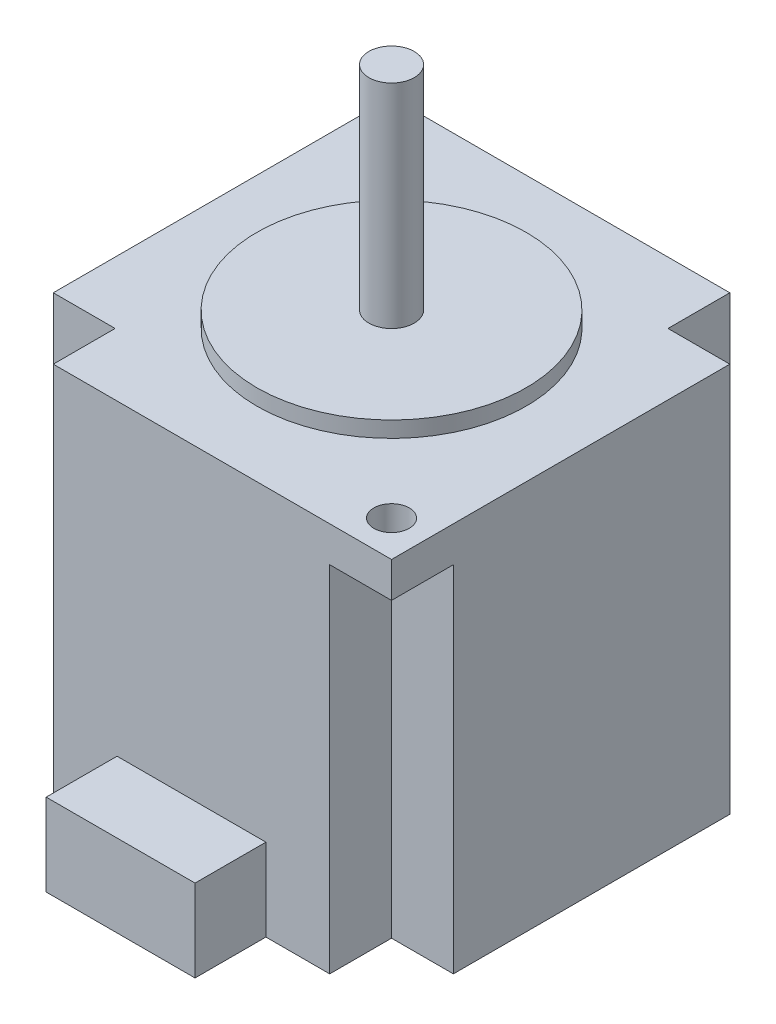
ISO-10303-21;
HEADER;
FILE_DESCRIPTION(('STEP AP214'),'2;1');
FILE_NAME('part.step','',(''),(''),'','','');
FILE_SCHEMA(('AUTOMOTIVE_DESIGN { 1 0 10303 214 1 1 1 1 }'));
ENDSEC;
DATA;
#1=APPLICATION_CONTEXT('core data for automotive mechanical design processes');
#2=APPLICATION_PROTOCOL_DEFINITION('international standard','automotive_design',2000,#1);
#3=PRODUCT_CONTEXT('',#1,'mechanical');
#4=PRODUCT('Part','Part','',(#3));
#5=PRODUCT_RELATED_PRODUCT_CATEGORY('part','',(#4));
#6=PRODUCT_DEFINITION_FORMATION('','',#4);
#7=PRODUCT_DEFINITION_CONTEXT('part definition',#1,'design');
#8=PRODUCT_DEFINITION('design','',#6,#7);
#9=PRODUCT_DEFINITION_SHAPE('','',#8);
#10=(LENGTH_UNIT() NAMED_UNIT(*) SI_UNIT(.MILLI.,.METRE.));
#11=(NAMED_UNIT(*) PLANE_ANGLE_UNIT() SI_UNIT($,.RADIAN.));
#12=(NAMED_UNIT(*) SI_UNIT($,.STERADIAN.) SOLID_ANGLE_UNIT());
#13=UNCERTAINTY_MEASURE_WITH_UNIT(LENGTH_MEASURE(1.E-05),#10,'distance_accuracy_value','');
#14=(GEOMETRIC_REPRESENTATION_CONTEXT(3) GLOBAL_UNCERTAINTY_ASSIGNED_CONTEXT((#13)) GLOBAL_UNIT_ASSIGNED_CONTEXT((#10,
#11,#12)) REPRESENTATION_CONTEXT('',''));
#15=CARTESIAN_POINT('',(0.,0.,0.));
#16=DIRECTION('',(0.,0.,1.));
#17=DIRECTION('',(1.,0.,0.));
#18=AXIS2_PLACEMENT_3D('',#15,#16,#17);
#19=CARTESIAN_POINT('',(-28.225,55.,28.225));
#20=DIRECTION('',(0.,0.,-1.));
#21=DIRECTION('',(-1.,0.,0.));
#22=AXIS2_PLACEMENT_3D('',#19,#20,#21);
#23=PLANE('',#22);
#24=DIRECTION('',(0.,-1.,0.));
#25=VECTOR('',#24,1.);
#26=CARTESIAN_POINT('',(-10.5,11.6,28.225));
#27=LINE('',#26,#25);
#28=CARTESIAN_POINT('',(-10.5,11.6,28.225));
#29=VERTEX_POINT('',#28);
#30=CARTESIAN_POINT('',(-10.5,0.,28.225));
#31=VERTEX_POINT('',#30);
#32=EDGE_CURVE('E187',#29,#31,#27,.T.);
#33=ORIENTED_EDGE('',*,*,#32,.F.);
#34=DIRECTION('',(1.,0.,0.));
#35=VECTOR('',#34,1.);
#36=CARTESIAN_POINT('',(0.,11.6,28.225));
#37=LINE('',#36,#35);
#38=CARTESIAN_POINT('',(10.5,11.6,28.225));
#39=VERTEX_POINT('',#38);
#40=EDGE_CURVE('E180',#29,#39,#37,.T.);
#41=ORIENTED_EDGE('',*,*,#40,.T.);
#42=DIRECTION('',(0.,-1.,0.));
#43=VECTOR('',#42,1.);
#44=CARTESIAN_POINT('',(10.5,11.6,28.225));
#45=LINE('',#44,#43);
#46=CARTESIAN_POINT('',(10.5,0.,28.225));
#47=VERTEX_POINT('',#46);
#48=EDGE_CURVE('E166',#39,#47,#45,.T.);
#49=ORIENTED_EDGE('',*,*,#48,.T.);
#50=DIRECTION('',(1.,0.,0.));
#51=VECTOR('',#50,1.);
#52=CARTESIAN_POINT('',(-28.225,0.,28.225));
#53=LINE('',#52,#51);
#54=CARTESIAN_POINT('',(19.5,0.,28.225));
#55=VERTEX_POINT('',#54);
#56=EDGE_CURVE('E316',#47,#55,#53,.T.);
#57=ORIENTED_EDGE('',*,*,#56,.T.);
#58=DIRECTION('',(0.,-1.,0.));
#59=VECTOR('',#58,1.);
#60=CARTESIAN_POINT('',(19.5,50.,28.225));
#61=LINE('',#60,#59);
#62=CARTESIAN_POINT('',(19.5,50.,28.225));
#63=VERTEX_POINT('',#62);
#64=EDGE_CURVE('E219',#63,#55,#61,.T.);
#65=ORIENTED_EDGE('',*,*,#64,.F.);
#66=DIRECTION('',(1.,0.,0.));
#67=VECTOR('',#66,1.);
#68=CARTESIAN_POINT('',(19.5,50.,28.225));
#69=LINE('',#68,#67);
#70=CARTESIAN_POINT('',(28.225,50.,28.225));
#71=VERTEX_POINT('',#70);
#72=EDGE_CURVE('E216',#63,#71,#69,.T.);
#73=ORIENTED_EDGE('',*,*,#72,.T.);
#74=DIRECTION('',(0.,-1.,0.));
#75=VECTOR('',#74,1.);
#76=CARTESIAN_POINT('',(28.225,55.,28.225));
#77=LINE('',#76,#75);
#78=CARTESIAN_POINT('',(28.225,55.,28.225));
#79=VERTEX_POINT('',#78);
#80=EDGE_CURVE('E309',#79,#71,#77,.T.);
#81=ORIENTED_EDGE('',*,*,#80,.F.);
#82=DIRECTION('',(1.,0.,0.));
#83=VECTOR('',#82,1.);
#84=CARTESIAN_POINT('',(-28.225,55.,28.225));
#85=LINE('',#84,#83);
#86=CARTESIAN_POINT('',(-19.5,55.,28.225));
#87=VERTEX_POINT('',#86);
#88=EDGE_CURVE('E307',#87,#79,#85,.T.);
#89=ORIENTED_EDGE('',*,*,#88,.F.);
#90=DIRECTION('',(0.,-1.,0.));
#91=VECTOR('',#90,1.);
#92=CARTESIAN_POINT('',(-19.5,67.3390133317052,28.225));
#93=LINE('',#92,#91);
#94=CARTESIAN_POINT('',(-19.5,0.,28.225));
#95=VERTEX_POINT('',#94);
#96=EDGE_CURVE('E266',#87,#95,#93,.T.);
#97=ORIENTED_EDGE('',*,*,#96,.T.);
#98=EDGE_CURVE('E302',#95,#31,#53,.T.);
#99=ORIENTED_EDGE('',*,*,#98,.T.);
#100=EDGE_LOOP('',(#33,#41,#49,#57,#65,#73,#81,#89,#97,#99));
#101=FACE_BOUND('',#100,.T.);
#102=ADVANCED_FACE('F40',(#101),#23,.F.);
#103=CARTESIAN_POINT('',(28.225,55.,-28.225));
#104=DIRECTION('',(-1.,0.,0.));
#105=DIRECTION('',(0.,0.,1.));
#106=AXIS2_PLACEMENT_3D('',#103,#104,#105);
#107=PLANE('',#106);
#108=DIRECTION('',(0.,-1.,0.));
#109=VECTOR('',#108,1.);
#110=CARTESIAN_POINT('',(28.225,50.,19.5));
#111=LINE('',#110,#109);
#112=CARTESIAN_POINT('',(28.225,50.,19.5));
#113=VERTEX_POINT('',#112);
#114=CARTESIAN_POINT('',(28.225,0.,19.5));
#115=VERTEX_POINT('',#114);
#116=EDGE_CURVE('E230',#113,#115,#111,.T.);
#117=ORIENTED_EDGE('',*,*,#116,.T.);
#118=DIRECTION('',(0.,0.,-1.));
#119=VECTOR('',#118,1.);
#120=CARTESIAN_POINT('',(28.225,0.,-28.225));
#121=LINE('',#120,#119);
#122=CARTESIAN_POINT('',(28.225,0.,-19.5));
#123=VERTEX_POINT('',#122);
#124=EDGE_CURVE('E295',#115,#123,#121,.T.);
#125=ORIENTED_EDGE('',*,*,#124,.T.);
#126=DIRECTION('',(0.,-1.,0.));
#127=VECTOR('',#126,1.);
#128=CARTESIAN_POINT('',(28.225,67.3390133317052,-19.5));
#129=LINE('',#128,#127);
#130=CARTESIAN_POINT('',(28.225,55.,-19.5));
#131=VERTEX_POINT('',#130);
#132=EDGE_CURVE('E273',#131,#123,#129,.T.);
#133=ORIENTED_EDGE('',*,*,#132,.F.);
#134=DIRECTION('',(0.,0.,-1.));
#135=VECTOR('',#134,1.);
#136=CARTESIAN_POINT('',(28.225,55.,-28.225));
#137=LINE('',#136,#135);
#138=EDGE_CURVE('E298',#79,#131,#137,.T.);
#139=ORIENTED_EDGE('',*,*,#138,.F.);
#140=ORIENTED_EDGE('',*,*,#80,.T.);
#141=DIRECTION('',(0.,0.,-1.));
#142=VECTOR('',#141,1.);
#143=CARTESIAN_POINT('',(28.225,50.,28.225));
#144=LINE('',#143,#142);
#145=EDGE_CURVE('E208',#71,#113,#144,.T.);
#146=ORIENTED_EDGE('',*,*,#145,.T.);
#147=EDGE_LOOP('',(#117,#125,#133,#139,#140,#146));
#148=FACE_BOUND('',#147,.T.);
#149=ADVANCED_FACE('F42',(#148),#107,.F.);
#150=CARTESIAN_POINT('',(-28.225,55.,-28.225));
#151=DIRECTION('',(0.,0.,1.));
#152=DIRECTION('',(1.,0.,0.));
#153=AXIS2_PLACEMENT_3D('',#150,#151,#152);
#154=PLANE('',#153);
#155=DIRECTION('',(0.,-1.,0.));
#156=VECTOR('',#155,1.);
#157=CARTESIAN_POINT('',(-19.5,50.,-28.225));
#158=LINE('',#157,#156);
#159=CARTESIAN_POINT('',(-19.5,50.,-28.225));
#160=VERTEX_POINT('',#159);
#161=CARTESIAN_POINT('',(-19.5,0.,-28.225));
#162=VERTEX_POINT('',#161);
#163=EDGE_CURVE('E65',#160,#162,#158,.T.);
#164=ORIENTED_EDGE('',*,*,#163,.F.);
#165=DIRECTION('',(-1.,0.,0.));
#166=VECTOR('',#165,1.);
#167=CARTESIAN_POINT('',(-19.5,50.,-28.225));
#168=LINE('',#167,#166);
#169=CARTESIAN_POINT('',(-28.225,50.,-28.225));
#170=VERTEX_POINT('',#169);
#171=EDGE_CURVE('E242',#160,#170,#168,.T.);
#172=ORIENTED_EDGE('',*,*,#171,.T.);
#173=DIRECTION('',(0.,-1.,0.));
#174=VECTOR('',#173,1.);
#175=CARTESIAN_POINT('',(-28.225,55.,-28.225));
#176=LINE('',#175,#174);
#177=CARTESIAN_POINT('',(-28.225,55.,-28.225));
#178=VERTEX_POINT('',#177);
#179=EDGE_CURVE('E44',#178,#170,#176,.T.);
#180=ORIENTED_EDGE('',*,*,#179,.F.);
#181=DIRECTION('',(-1.,0.,0.));
#182=VECTOR('',#181,1.);
#183=CARTESIAN_POINT('',(-28.225,55.,-28.225));
#184=LINE('',#183,#182);
#185=CARTESIAN_POINT('',(19.5,55.,-28.225));
#186=VERTEX_POINT('',#185);
#187=EDGE_CURVE('E301',#186,#178,#184,.T.);
#188=ORIENTED_EDGE('',*,*,#187,.F.);
#189=DIRECTION('',(0.,-1.,0.));
#190=VECTOR('',#189,1.);
#191=CARTESIAN_POINT('',(19.5,67.3390133317052,-28.225));
#192=LINE('',#191,#190);
#193=CARTESIAN_POINT('',(19.5,0.,-28.225));
#194=VERTEX_POINT('',#193);
#195=EDGE_CURVE('E267',#186,#194,#192,.T.);
#196=ORIENTED_EDGE('',*,*,#195,.T.);
#197=DIRECTION('',(-1.,0.,0.));
#198=VECTOR('',#197,1.);
#199=CARTESIAN_POINT('',(-28.225,0.,-28.225));
#200=LINE('',#199,#198);
#201=EDGE_CURVE('E311',#194,#162,#200,.T.);
#202=ORIENTED_EDGE('',*,*,#201,.T.);
#203=EDGE_LOOP('',(#164,#172,#180,#188,#196,#202));
#204=FACE_BOUND('',#203,.T.);
#205=ADVANCED_FACE('F329',(#204),#154,.F.);
#206=CARTESIAN_POINT('',(-28.225,55.,-28.225));
#207=DIRECTION('',(1.,0.,0.));
#208=DIRECTION('',(0.,0.,-1.));
#209=AXIS2_PLACEMENT_3D('',#206,#207,#208);
#210=PLANE('',#209);
#211=DIRECTION('',(0.,-1.,0.));
#212=VECTOR('',#211,1.);
#213=CARTESIAN_POINT('',(-28.225,50.,-19.5));
#214=LINE('',#213,#212);
#215=CARTESIAN_POINT('',(-28.225,50.,-19.5));
#216=VERTEX_POINT('',#215);
#217=CARTESIAN_POINT('',(-28.225,0.,-19.5));
#218=VERTEX_POINT('',#217);
#219=EDGE_CURVE('E204',#216,#218,#214,.T.);
#220=ORIENTED_EDGE('',*,*,#219,.T.);
#221=DIRECTION('',(0.,0.,1.));
#222=VECTOR('',#221,1.);
#223=CARTESIAN_POINT('',(-28.225,0.,-28.225));
#224=LINE('',#223,#222);
#225=CARTESIAN_POINT('',(-28.225,0.,19.5));
#226=VERTEX_POINT('',#225);
#227=EDGE_CURVE('E314',#218,#226,#224,.T.);
#228=ORIENTED_EDGE('',*,*,#227,.T.);
#229=DIRECTION('',(0.,-1.,0.));
#230=VECTOR('',#229,1.);
#231=CARTESIAN_POINT('',(-28.225,67.3390133317052,19.5));
#232=LINE('',#231,#230);
#233=CARTESIAN_POINT('',(-28.225,55.,19.5));
#234=VERTEX_POINT('',#233);
#235=EDGE_CURVE('E256',#234,#226,#232,.T.);
#236=ORIENTED_EDGE('',*,*,#235,.F.);
#237=DIRECTION('',(0.,0.,1.));
#238=VECTOR('',#237,1.);
#239=CARTESIAN_POINT('',(-28.225,55.,-28.225));
#240=LINE('',#239,#238);
#241=EDGE_CURVE('E304',#178,#234,#240,.T.);
#242=ORIENTED_EDGE('',*,*,#241,.F.);
#243=ORIENTED_EDGE('',*,*,#179,.T.);
#244=DIRECTION('',(0.,0.,1.));
#245=VECTOR('',#244,1.);
#246=CARTESIAN_POINT('',(-28.225,50.,-28.225));
#247=LINE('',#246,#245);
#248=EDGE_CURVE('E248',#170,#216,#247,.T.);
#249=ORIENTED_EDGE('',*,*,#248,.T.);
#250=EDGE_LOOP('',(#220,#228,#236,#242,#243,#249));
#251=FACE_BOUND('',#250,.T.);
#252=ADVANCED_FACE('F325',(#251),#210,.F.);
#253=CARTESIAN_POINT('',(0.,0.,0.));
#254=DIRECTION('',(0.,1.,0.));
#255=DIRECTION('',(0.,0.,1.));
#256=AXIS2_PLACEMENT_3D('',#253,#254,#255);
#257=PLANE('',#256);
#258=CARTESIAN_POINT('',(0.,0.,0.));
#259=DIRECTION('',(0.,-1.,0.));
#260=DIRECTION('',(0.,0.,-1.));
#261=AXIS2_PLACEMENT_3D('',#258,#259,#260);
#262=CIRCLE('',#261,4.5);
#263=CARTESIAN_POINT('',(0.,0.,-4.5));
#264=VERTEX_POINT('',#263);
#265=EDGE_CURVE('E625',#264,#264,#262,.T.);
#266=ORIENTED_EDGE('',*,*,#265,.F.);
#267=EDGE_LOOP('',(#266));
#268=FACE_BOUND('',#267,.T.);
#269=DIRECTION('',(-1.,0.,0.));
#270=VECTOR('',#269,1.);
#271=CARTESIAN_POINT('',(28.225,0.,19.5));
#272=LINE('',#271,#270);
#273=CARTESIAN_POINT('',(19.5,0.,19.5));
#274=VERTEX_POINT('',#273);
#275=EDGE_CURVE('E220',#115,#274,#272,.T.);
#276=ORIENTED_EDGE('',*,*,#275,.T.);
#277=DIRECTION('',(0.,0.,1.));
#278=VECTOR('',#277,1.);
#279=CARTESIAN_POINT('',(19.5,0.,19.5));
#280=LINE('',#279,#278);
#281=EDGE_CURVE('E212',#274,#55,#280,.T.);
#282=ORIENTED_EDGE('',*,*,#281,.T.);
#283=ORIENTED_EDGE('',*,*,#56,.F.);
#284=DIRECTION('',(0.,0.,1.));
#285=VECTOR('',#284,1.);
#286=CARTESIAN_POINT('',(10.5,0.,38.225));
#287=LINE('',#286,#285);
#288=CARTESIAN_POINT('',(10.5,0.,38.225));
#289=VERTEX_POINT('',#288);
#290=EDGE_CURVE('E57',#47,#289,#287,.T.);
#291=ORIENTED_EDGE('',*,*,#290,.T.);
#292=DIRECTION('',(-1.,0.,0.));
#293=VECTOR('',#292,1.);
#294=CARTESIAN_POINT('',(-10.5,0.,38.225));
#295=LINE('',#294,#293);
#296=CARTESIAN_POINT('',(-10.5,0.,38.225));
#297=VERTEX_POINT('',#296);
#298=EDGE_CURVE('E191',#289,#297,#295,.T.);
#299=ORIENTED_EDGE('',*,*,#298,.T.);
#300=DIRECTION('',(0.,0.,-1.));
#301=VECTOR('',#300,1.);
#302=CARTESIAN_POINT('',(-10.5,0.,28.225));
#303=LINE('',#302,#301);
#304=EDGE_CURVE('E188',#297,#31,#303,.T.);
#305=ORIENTED_EDGE('',*,*,#304,.T.);
#306=ORIENTED_EDGE('',*,*,#98,.F.);
#307=DIRECTION('',(0.,0.,1.));
#308=VECTOR('',#307,1.);
#309=CARTESIAN_POINT('',(-19.5,0.,19.5));
#310=LINE('',#309,#308);
#311=CARTESIAN_POINT('',(-19.5,0.,19.5));
#312=VERTEX_POINT('',#311);
#313=EDGE_CURVE('E258',#312,#95,#310,.T.);
#314=ORIENTED_EDGE('',*,*,#313,.F.);
#315=DIRECTION('',(-1.,0.,0.));
#316=VECTOR('',#315,1.);
#317=CARTESIAN_POINT('',(-19.5,0.,19.5));
#318=LINE('',#317,#316);
#319=EDGE_CURVE('E253',#312,#226,#318,.T.);
#320=ORIENTED_EDGE('',*,*,#319,.T.);
#321=ORIENTED_EDGE('',*,*,#227,.F.);
#322=DIRECTION('',(1.,0.,0.));
#323=VECTOR('',#322,1.);
#324=CARTESIAN_POINT('',(-28.225,0.,-19.5));
#325=LINE('',#324,#323);
#326=CARTESIAN_POINT('',(-19.5,0.,-19.5));
#327=VERTEX_POINT('',#326);
#328=EDGE_CURVE('E223',#218,#327,#325,.T.);
#329=ORIENTED_EDGE('',*,*,#328,.T.);
#330=DIRECTION('',(0.,0.,-1.));
#331=VECTOR('',#330,1.);
#332=CARTESIAN_POINT('',(-19.5,0.,-19.5));
#333=LINE('',#332,#331);
#334=EDGE_CURVE('E240',#327,#162,#333,.T.);
#335=ORIENTED_EDGE('',*,*,#334,.T.);
#336=ORIENTED_EDGE('',*,*,#201,.F.);
#337=DIRECTION('',(0.,0.,1.));
#338=VECTOR('',#337,1.);
#339=CARTESIAN_POINT('',(19.5,0.,-28.225));
#340=LINE('',#339,#338);
#341=CARTESIAN_POINT('',(19.5,0.,-19.5));
#342=VERTEX_POINT('',#341);
#343=EDGE_CURVE('E280',#194,#342,#340,.T.);
#344=ORIENTED_EDGE('',*,*,#343,.T.);
#345=DIRECTION('',(1.,0.,0.));
#346=VECTOR('',#345,1.);
#347=CARTESIAN_POINT('',(19.5,0.,-19.5));
#348=LINE('',#347,#346);
#349=EDGE_CURVE('E276',#342,#123,#348,.T.);
#350=ORIENTED_EDGE('',*,*,#349,.T.);
#351=ORIENTED_EDGE('',*,*,#124,.F.);
#352=EDGE_LOOP('',(#276,#282,#283,#291,#299,#305,#306,#314,#320,#321,#329,#335,#336,#344,#350,#351));
#353=FACE_BOUND('',#352,.T.);
#354=ADVANCED_FACE('F342',(#268,#353),#257,.F.);
#355=CARTESIAN_POINT('',(0.,55.,0.));
#356=DIRECTION('',(0.,1.,0.));
#357=DIRECTION('',(0.,0.,1.));
#358=AXIS2_PLACEMENT_3D('',#355,#356,#357);
#359=PLANE('',#358);
#360=CARTESIAN_POINT('',(-23.175,55.,-23.175));
#361=DIRECTION('',(0.,1.,0.));
#362=DIRECTION('',(0.,0.,1.));
#363=AXIS2_PLACEMENT_3D('',#360,#361,#362);
#364=CIRCLE('',#363,2.5);
#365=CARTESIAN_POINT('',(-23.175,55.,-20.675));
#366=VERTEX_POINT('',#365);
#367=EDGE_CURVE('E613',#366,#366,#364,.T.);
#368=ORIENTED_EDGE('',*,*,#367,.F.);
#369=EDGE_LOOP('',(#368));
#370=FACE_BOUND('',#369,.T.);
#371=CARTESIAN_POINT('',(23.175,55.,23.175));
#372=DIRECTION('',(0.,1.,0.));
#373=DIRECTION('',(0.,0.,1.));
#374=AXIS2_PLACEMENT_3D('',#371,#372,#373);
#375=CIRCLE('',#374,2.5);
#376=CARTESIAN_POINT('',(23.175,55.,25.675));
#377=VERTEX_POINT('',#376);
#378=EDGE_CURVE('E618',#377,#377,#375,.T.);
#379=ORIENTED_EDGE('',*,*,#378,.F.);
#380=EDGE_LOOP('',(#379));
#381=FACE_BOUND('',#380,.T.);
#382=DIRECTION('',(0.,0.,1.));
#383=VECTOR('',#382,1.);
#384=CARTESIAN_POINT('',(-19.5,55.,19.5));
#385=LINE('',#384,#383);
#386=CARTESIAN_POINT('',(-19.5,55.,19.5));
#387=VERTEX_POINT('',#386);
#388=EDGE_CURVE('E263',#387,#87,#385,.T.);
#389=ORIENTED_EDGE('',*,*,#388,.T.);
#390=ORIENTED_EDGE('',*,*,#88,.T.);
#391=ORIENTED_EDGE('',*,*,#138,.T.);
#392=DIRECTION('',(1.,0.,0.));
#393=VECTOR('',#392,1.);
#394=CARTESIAN_POINT('',(19.5,55.,-19.5));
#395=LINE('',#394,#393);
#396=CARTESIAN_POINT('',(19.5,55.,-19.5));
#397=VERTEX_POINT('',#396);
#398=EDGE_CURVE('E233',#397,#131,#395,.T.);
#399=ORIENTED_EDGE('',*,*,#398,.F.);
#400=DIRECTION('',(0.,0.,1.));
#401=VECTOR('',#400,1.);
#402=CARTESIAN_POINT('',(19.5,55.,-28.225));
#403=LINE('',#402,#401);
#404=EDGE_CURVE('E277',#186,#397,#403,.T.);
#405=ORIENTED_EDGE('',*,*,#404,.F.);
#406=ORIENTED_EDGE('',*,*,#187,.T.);
#407=ORIENTED_EDGE('',*,*,#241,.T.);
#408=DIRECTION('',(-1.,0.,0.));
#409=VECTOR('',#408,1.);
#410=CARTESIAN_POINT('',(-19.5,55.,19.5));
#411=LINE('',#410,#409);
#412=EDGE_CURVE('E260',#387,#234,#411,.T.);
#413=ORIENTED_EDGE('',*,*,#412,.F.);
#414=EDGE_LOOP('',(#389,#390,#391,#399,#405,#406,#407,#413));
#415=FACE_BOUND('',#414,.T.);
#416=CARTESIAN_POINT('',(0.,55.,0.));
#417=DIRECTION('',(0.,1.,0.));
#418=DIRECTION('',(0.,0.,1.));
#419=AXIS2_PLACEMENT_3D('',#416,#417,#418);
#420=CIRCLE('',#419,19.);
#421=CARTESIAN_POINT('',(0.,55.,19.));
#422=VERTEX_POINT('',#421);
#423=EDGE_CURVE('E49',#422,#422,#420,.T.);
#424=ORIENTED_EDGE('',*,*,#423,.F.);
#425=EDGE_LOOP('',(#424));
#426=FACE_BOUND('',#425,.T.);
#427=ADVANCED_FACE('F354',(#370,#381,#415,#426),#359,.T.);
#428=CARTESIAN_POINT('',(0.,57.25,0.));
#429=DIRECTION('',(0.,-1.,0.));
#430=DIRECTION('',(0.,0.,-1.));
#431=AXIS2_PLACEMENT_3D('',#428,#429,#430);
#432=CYLINDRICAL_SURFACE('',#431,19.);
#433=CARTESIAN_POINT('',(0.,57.25,0.));
#434=DIRECTION('',(0.,1.,0.));
#435=DIRECTION('',(0.,0.,1.));
#436=AXIS2_PLACEMENT_3D('',#433,#434,#435);
#437=CIRCLE('',#436,19.);
#438=CARTESIAN_POINT('',(0.,57.25,19.));
#439=VERTEX_POINT('',#438);
#440=EDGE_CURVE('E291',#439,#439,#437,.T.);
#441=ORIENTED_EDGE('',*,*,#440,.F.);
#442=EDGE_LOOP('',(#441));
#443=FACE_BOUND('',#442,.T.);
#444=ORIENTED_EDGE('',*,*,#423,.T.);
#445=EDGE_LOOP('',(#444));
#446=FACE_BOUND('',#445,.T.);
#447=ADVANCED_FACE('F421',(#443,#446),#432,.T.);
#448=CARTESIAN_POINT('',(0.,57.25,0.));
#449=DIRECTION('',(0.,1.,0.));
#450=DIRECTION('',(0.,0.,1.));
#451=AXIS2_PLACEMENT_3D('',#448,#449,#450);
#452=PLANE('',#451);
#453=CARTESIAN_POINT('',(0.,57.25,0.));
#454=DIRECTION('',(0.,1.,0.));
#455=DIRECTION('',(0.,0.,1.));
#456=AXIS2_PLACEMENT_3D('',#453,#454,#455);
#457=CIRCLE('',#456,3.2);
#458=CARTESIAN_POINT('',(0.,57.25,3.2));
#459=VERTEX_POINT('',#458);
#460=EDGE_CURVE('E11',#459,#459,#457,.T.);
#461=ORIENTED_EDGE('',*,*,#460,.F.);
#462=EDGE_LOOP('',(#461));
#463=FACE_BOUND('',#462,.T.);
#464=ORIENTED_EDGE('',*,*,#440,.T.);
#465=EDGE_LOOP('',(#464));
#466=FACE_BOUND('',#465,.T.);
#467=ADVANCED_FACE('F429',(#463,#466),#452,.T.);
#468=CARTESIAN_POINT('',(0.,87.25,0.));
#469=DIRECTION('',(0.,-1.,0.));
#470=DIRECTION('',(0.,0.,-1.));
#471=AXIS2_PLACEMENT_3D('',#468,#469,#470);
#472=CYLINDRICAL_SURFACE('',#471,3.2);
#473=CARTESIAN_POINT('',(0.,87.25,0.));
#474=DIRECTION('',(0.,1.,0.));
#475=DIRECTION('',(0.,0.,1.));
#476=AXIS2_PLACEMENT_3D('',#473,#474,#475);
#477=CIRCLE('',#476,3.2);
#478=CARTESIAN_POINT('',(0.,87.25,3.2));
#479=VERTEX_POINT('',#478);
#480=EDGE_CURVE('E262',#479,#479,#477,.T.);
#481=ORIENTED_EDGE('',*,*,#480,.F.);
#482=EDGE_LOOP('',(#481));
#483=FACE_BOUND('',#482,.T.);
#484=ORIENTED_EDGE('',*,*,#460,.T.);
#485=EDGE_LOOP('',(#484));
#486=FACE_BOUND('',#485,.T.);
#487=ADVANCED_FACE('F438',(#483,#486),#472,.T.);
#488=CARTESIAN_POINT('',(0.,87.25,0.));
#489=DIRECTION('',(0.,1.,0.));
#490=DIRECTION('',(0.,0.,1.));
#491=AXIS2_PLACEMENT_3D('',#488,#489,#490);
#492=PLANE('',#491);
#493=ORIENTED_EDGE('',*,*,#480,.T.);
#494=EDGE_LOOP('',(#493));
#495=FACE_BOUND('',#494,.T.);
#496=ADVANCED_FACE('F446',(#495),#492,.T.);
#497=CARTESIAN_POINT('',(19.5,67.3390133317052,-28.225));
#498=DIRECTION('',(1.,0.,0.));
#499=DIRECTION('',(0.,0.,-1.));
#500=AXIS2_PLACEMENT_3D('',#497,#498,#499);
#501=PLANE('',#500);
#502=ORIENTED_EDGE('',*,*,#404,.T.);
#503=DIRECTION('',(0.,-1.,0.));
#504=VECTOR('',#503,1.);
#505=CARTESIAN_POINT('',(19.5,67.3390133317052,-19.5));
#506=LINE('',#505,#504);
#507=EDGE_CURVE('E278',#397,#342,#506,.T.);
#508=ORIENTED_EDGE('',*,*,#507,.T.);
#509=ORIENTED_EDGE('',*,*,#343,.F.);
#510=ORIENTED_EDGE('',*,*,#195,.F.);
#511=EDGE_LOOP('',(#502,#508,#509,#510));
#512=FACE_BOUND('',#511,.T.);
#513=ADVANCED_FACE('F359',(#512),#501,.T.);
#514=CARTESIAN_POINT('',(19.5,67.3390133317052,-19.5));
#515=DIRECTION('',(0.,0.,-1.));
#516=DIRECTION('',(-1.,0.,0.));
#517=AXIS2_PLACEMENT_3D('',#514,#515,#516);
#518=PLANE('',#517);
#519=ORIENTED_EDGE('',*,*,#398,.T.);
#520=ORIENTED_EDGE('',*,*,#132,.T.);
#521=ORIENTED_EDGE('',*,*,#349,.F.);
#522=ORIENTED_EDGE('',*,*,#507,.F.);
#523=EDGE_LOOP('',(#519,#520,#521,#522));
#524=FACE_BOUND('',#523,.T.);
#525=ADVANCED_FACE('F363',(#524),#518,.T.);
#526=CARTESIAN_POINT('',(-19.5,67.3390133317052,19.5));
#527=DIRECTION('',(1.,0.,0.));
#528=DIRECTION('',(0.,0.,-1.));
#529=AXIS2_PLACEMENT_3D('',#526,#527,#528);
#530=PLANE('',#529);
#531=DIRECTION('',(0.,-1.,0.));
#532=VECTOR('',#531,1.);
#533=CARTESIAN_POINT('',(-19.5,67.3390133317052,19.5));
#534=LINE('',#533,#532);
#535=EDGE_CURVE('E257',#387,#312,#534,.T.);
#536=ORIENTED_EDGE('',*,*,#535,.T.);
#537=ORIENTED_EDGE('',*,*,#313,.T.);
#538=ORIENTED_EDGE('',*,*,#96,.F.);
#539=ORIENTED_EDGE('',*,*,#388,.F.);
#540=EDGE_LOOP('',(#536,#537,#538,#539));
#541=FACE_BOUND('',#540,.T.);
#542=ADVANCED_FACE('F350',(#541),#530,.F.);
#543=CARTESIAN_POINT('',(-19.5,67.3390133317052,19.5));
#544=DIRECTION('',(0.,0.,1.));
#545=DIRECTION('',(1.,0.,0.));
#546=AXIS2_PLACEMENT_3D('',#543,#544,#545);
#547=PLANE('',#546);
#548=ORIENTED_EDGE('',*,*,#412,.T.);
#549=ORIENTED_EDGE('',*,*,#235,.T.);
#550=ORIENTED_EDGE('',*,*,#319,.F.);
#551=ORIENTED_EDGE('',*,*,#535,.F.);
#552=EDGE_LOOP('',(#548,#549,#550,#551));
#553=FACE_BOUND('',#552,.T.);
#554=ADVANCED_FACE('F345',(#553),#547,.T.);
#555=CARTESIAN_POINT('',(28.225,50.,19.5));
#556=DIRECTION('',(0.,0.,1.));
#557=DIRECTION('',(1.,0.,0.));
#558=AXIS2_PLACEMENT_3D('',#555,#556,#557);
#559=PLANE('',#558);
#560=ORIENTED_EDGE('',*,*,#275,.F.);
#561=ORIENTED_EDGE('',*,*,#116,.F.);
#562=DIRECTION('',(-1.,0.,0.));
#563=VECTOR('',#562,1.);
#564=CARTESIAN_POINT('',(28.225,50.,19.5));
#565=LINE('',#564,#563);
#566=CARTESIAN_POINT('',(19.5,50.,19.5));
#567=VERTEX_POINT('',#566);
#568=EDGE_CURVE('E211',#113,#567,#565,.T.);
#569=ORIENTED_EDGE('',*,*,#568,.T.);
#570=DIRECTION('',(0.,-1.,0.));
#571=VECTOR('',#570,1.);
#572=CARTESIAN_POINT('',(19.5,50.,19.5));
#573=LINE('',#572,#571);
#574=EDGE_CURVE('E228',#567,#274,#573,.T.);
#575=ORIENTED_EDGE('',*,*,#574,.T.);
#576=EDGE_LOOP('',(#560,#561,#569,#575));
#577=FACE_BOUND('',#576,.T.);
#578=ADVANCED_FACE('F367',(#577),#559,.T.);
#579=CARTESIAN_POINT('',(19.5,50.,19.5));
#580=DIRECTION('',(1.,0.,0.));
#581=DIRECTION('',(0.,0.,-1.));
#582=AXIS2_PLACEMENT_3D('',#579,#580,#581);
#583=PLANE('',#582);
#584=ORIENTED_EDGE('',*,*,#281,.F.);
#585=ORIENTED_EDGE('',*,*,#574,.F.);
#586=DIRECTION('',(0.,0.,1.));
#587=VECTOR('',#586,1.);
#588=CARTESIAN_POINT('',(19.5,50.,19.5));
#589=LINE('',#588,#587);
#590=EDGE_CURVE('E214',#567,#63,#589,.T.);
#591=ORIENTED_EDGE('',*,*,#590,.T.);
#592=ORIENTED_EDGE('',*,*,#64,.T.);
#593=EDGE_LOOP('',(#584,#585,#591,#592));
#594=FACE_BOUND('',#593,.T.);
#595=ADVANCED_FACE('F371',(#594),#583,.T.);
#596=CARTESIAN_POINT('',(0.,50.,0.));
#597=DIRECTION('',(0.,1.,0.));
#598=DIRECTION('',(0.,0.,1.));
#599=AXIS2_PLACEMENT_3D('',#596,#597,#598);
#600=PLANE('',#599);
#601=CARTESIAN_POINT('',(23.175,50.,23.175));
#602=DIRECTION('',(0.,1.,0.));
#603=DIRECTION('',(0.,0.,1.));
#604=AXIS2_PLACEMENT_3D('',#601,#602,#603);
#605=CIRCLE('',#604,2.5);
#606=CARTESIAN_POINT('',(23.175,50.,25.675));
#607=VERTEX_POINT('',#606);
#608=EDGE_CURVE('E194',#607,#607,#605,.F.);
#609=ORIENTED_EDGE('',*,*,#608,.F.);
#610=EDGE_LOOP('',(#609));
#611=FACE_BOUND('',#610,.T.);
#612=ORIENTED_EDGE('',*,*,#145,.F.);
#613=ORIENTED_EDGE('',*,*,#72,.F.);
#614=ORIENTED_EDGE('',*,*,#590,.F.);
#615=ORIENTED_EDGE('',*,*,#568,.F.);
#616=EDGE_LOOP('',(#612,#613,#614,#615));
#617=FACE_BOUND('',#616,.T.);
#618=ADVANCED_FACE('F376',(#611,#617),#600,.F.);
#619=CARTESIAN_POINT('',(-28.225,50.,-19.5));
#620=DIRECTION('',(0.,0.,-1.));
#621=DIRECTION('',(-1.,0.,0.));
#622=AXIS2_PLACEMENT_3D('',#619,#620,#621);
#623=PLANE('',#622);
#624=ORIENTED_EDGE('',*,*,#328,.F.);
#625=ORIENTED_EDGE('',*,*,#219,.F.);
#626=DIRECTION('',(1.,0.,0.));
#627=VECTOR('',#626,1.);
#628=CARTESIAN_POINT('',(-28.225,50.,-19.5));
#629=LINE('',#628,#627);
#630=CARTESIAN_POINT('',(-19.5,50.,-19.5));
#631=VERTEX_POINT('',#630);
#632=EDGE_CURVE('E246',#216,#631,#629,.T.);
#633=ORIENTED_EDGE('',*,*,#632,.T.);
#634=DIRECTION('',(0.,-1.,0.));
#635=VECTOR('',#634,1.);
#636=CARTESIAN_POINT('',(-19.5,50.,-19.5));
#637=LINE('',#636,#635);
#638=EDGE_CURVE('E236',#631,#327,#637,.T.);
#639=ORIENTED_EDGE('',*,*,#638,.T.);
#640=EDGE_LOOP('',(#624,#625,#633,#639));
#641=FACE_BOUND('',#640,.T.);
#642=ADVANCED_FACE('F337',(#641),#623,.T.);
#643=CARTESIAN_POINT('',(-19.5,50.,-19.5));
#644=DIRECTION('',(-1.,0.,0.));
#645=DIRECTION('',(0.,0.,1.));
#646=AXIS2_PLACEMENT_3D('',#643,#644,#645);
#647=PLANE('',#646);
#648=ORIENTED_EDGE('',*,*,#334,.F.);
#649=ORIENTED_EDGE('',*,*,#638,.F.);
#650=DIRECTION('',(0.,0.,-1.));
#651=VECTOR('',#650,1.);
#652=CARTESIAN_POINT('',(-19.5,50.,-19.5));
#653=LINE('',#652,#651);
#654=EDGE_CURVE('E239',#631,#160,#653,.T.);
#655=ORIENTED_EDGE('',*,*,#654,.T.);
#656=ORIENTED_EDGE('',*,*,#163,.T.);
#657=EDGE_LOOP('',(#648,#649,#655,#656));
#658=FACE_BOUND('',#657,.T.);
#659=ADVANCED_FACE('F338',(#658),#647,.T.);
#660=CARTESIAN_POINT('',(0.,50.,0.));
#661=DIRECTION('',(0.,1.,0.));
#662=DIRECTION('',(0.,0.,1.));
#663=AXIS2_PLACEMENT_3D('',#660,#661,#662);
#664=PLANE('',#663);
#665=CARTESIAN_POINT('',(-23.175,50.,-23.175));
#666=DIRECTION('',(0.,1.,0.));
#667=DIRECTION('',(0.,0.,1.));
#668=AXIS2_PLACEMENT_3D('',#665,#666,#667);
#669=CIRCLE('',#668,2.5);
#670=CARTESIAN_POINT('',(-23.175,50.,-20.675));
#671=VERTEX_POINT('',#670);
#672=EDGE_CURVE('E200',#671,#671,#669,.F.);
#673=ORIENTED_EDGE('',*,*,#672,.F.);
#674=EDGE_LOOP('',(#673));
#675=FACE_BOUND('',#674,.T.);
#676=ORIENTED_EDGE('',*,*,#171,.F.);
#677=ORIENTED_EDGE('',*,*,#654,.F.);
#678=ORIENTED_EDGE('',*,*,#632,.F.);
#679=ORIENTED_EDGE('',*,*,#248,.F.);
#680=EDGE_LOOP('',(#676,#677,#678,#679));
#681=FACE_BOUND('',#680,.T.);
#682=ADVANCED_FACE('F333',(#675,#681),#664,.F.);
#683=CARTESIAN_POINT('',(-10.5,11.6,28.225));
#684=DIRECTION('',(-1.,0.,0.));
#685=DIRECTION('',(0.,0.,1.));
#686=AXIS2_PLACEMENT_3D('',#683,#684,#685);
#687=PLANE('',#686);
#688=ORIENTED_EDGE('',*,*,#304,.F.);
#689=DIRECTION('',(0.,-1.,0.));
#690=VECTOR('',#689,1.);
#691=CARTESIAN_POINT('',(-10.5,11.6,38.225));
#692=LINE('',#691,#690);
#693=CARTESIAN_POINT('',(-10.5,11.6,38.225));
#694=VERTEX_POINT('',#693);
#695=EDGE_CURVE('E205',#694,#297,#692,.T.);
#696=ORIENTED_EDGE('',*,*,#695,.F.);
#697=DIRECTION('',(0.,0.,-1.));
#698=VECTOR('',#697,1.);
#699=CARTESIAN_POINT('',(-10.5,11.6,28.225));
#700=LINE('',#699,#698);
#701=EDGE_CURVE('E174',#694,#29,#700,.T.);
#702=ORIENTED_EDGE('',*,*,#701,.T.);
#703=ORIENTED_EDGE('',*,*,#32,.T.);
#704=EDGE_LOOP('',(#688,#696,#702,#703));
#705=FACE_BOUND('',#704,.T.);
#706=ADVANCED_FACE('F519',(#705),#687,.T.);
#707=CARTESIAN_POINT('',(-10.5,11.6,38.225));
#708=DIRECTION('',(0.,0.,1.));
#709=DIRECTION('',(1.,0.,0.));
#710=AXIS2_PLACEMENT_3D('',#707,#708,#709);
#711=PLANE('',#710);
#712=ORIENTED_EDGE('',*,*,#298,.F.);
#713=DIRECTION('',(0.,-1.,0.));
#714=VECTOR('',#713,1.);
#715=CARTESIAN_POINT('',(10.5,11.6,38.225));
#716=LINE('',#715,#714);
#717=CARTESIAN_POINT('',(10.5,11.6,38.225));
#718=VERTEX_POINT('',#717);
#719=EDGE_CURVE('E173',#718,#289,#716,.T.);
#720=ORIENTED_EDGE('',*,*,#719,.F.);
#721=DIRECTION('',(-1.,0.,0.));
#722=VECTOR('',#721,1.);
#723=CARTESIAN_POINT('',(-10.5,11.6,38.225));
#724=LINE('',#723,#722);
#725=EDGE_CURVE('E183',#718,#694,#724,.T.);
#726=ORIENTED_EDGE('',*,*,#725,.T.);
#727=ORIENTED_EDGE('',*,*,#695,.T.);
#728=EDGE_LOOP('',(#712,#720,#726,#727));
#729=FACE_BOUND('',#728,.T.);
#730=ADVANCED_FACE('F524',(#729),#711,.T.);
#731=CARTESIAN_POINT('',(10.5,11.6,38.225));
#732=DIRECTION('',(1.,0.,0.));
#733=DIRECTION('',(0.,0.,-1.));
#734=AXIS2_PLACEMENT_3D('',#731,#732,#733);
#735=PLANE('',#734);
#736=ORIENTED_EDGE('',*,*,#290,.F.);
#737=ORIENTED_EDGE('',*,*,#48,.F.);
#738=DIRECTION('',(0.,0.,1.));
#739=VECTOR('',#738,1.);
#740=CARTESIAN_POINT('',(10.5,11.6,38.225));
#741=LINE('',#740,#739);
#742=EDGE_CURVE('E169',#39,#718,#741,.T.);
#743=ORIENTED_EDGE('',*,*,#742,.T.);
#744=ORIENTED_EDGE('',*,*,#719,.T.);
#745=EDGE_LOOP('',(#736,#737,#743,#744));
#746=FACE_BOUND('',#745,.T.);
#747=ADVANCED_FACE('F168',(#746),#735,.T.);
#748=CARTESIAN_POINT('',(0.,11.6,0.));
#749=DIRECTION('',(0.,1.,0.));
#750=DIRECTION('',(0.,0.,1.));
#751=AXIS2_PLACEMENT_3D('',#748,#749,#750);
#752=PLANE('',#751);
#753=ORIENTED_EDGE('',*,*,#40,.F.);
#754=ORIENTED_EDGE('',*,*,#701,.F.);
#755=ORIENTED_EDGE('',*,*,#725,.F.);
#756=ORIENTED_EDGE('',*,*,#742,.F.);
#757=EDGE_LOOP('',(#753,#754,#755,#756));
#758=FACE_BOUND('',#757,.T.);
#759=ADVANCED_FACE('F178',(#758),#752,.T.);
#760=CARTESIAN_POINT('',(-23.175,42.9289321881345,-23.175));
#761=DIRECTION('',(0.,1.,0.));
#762=DIRECTION('',(0.,0.,1.));
#763=AXIS2_PLACEMENT_3D('',#760,#761,#762);
#764=CYLINDRICAL_SURFACE('',#763,2.5);
#765=ORIENTED_EDGE('',*,*,#672,.T.);
#766=EDGE_LOOP('',(#765));
#767=FACE_BOUND('',#766,.T.);
#768=ORIENTED_EDGE('',*,*,#367,.T.);
#769=EDGE_LOOP('',(#768));
#770=FACE_BOUND('',#769,.T.);
#771=ADVANCED_FACE('F549',(#767,#770),#764,.F.);
#772=CARTESIAN_POINT('',(23.175,42.9289321881345,23.175));
#773=DIRECTION('',(0.,1.,0.));
#774=DIRECTION('',(0.,0.,1.));
#775=AXIS2_PLACEMENT_3D('',#772,#773,#774);
#776=CYLINDRICAL_SURFACE('',#775,2.5);
#777=ORIENTED_EDGE('',*,*,#608,.T.);
#778=EDGE_LOOP('',(#777));
#779=FACE_BOUND('',#778,.T.);
#780=ORIENTED_EDGE('',*,*,#378,.T.);
#781=EDGE_LOOP('',(#780));
#782=FACE_BOUND('',#781,.T.);
#783=ADVANCED_FACE('F559',(#779,#782),#776,.F.);
#784=CARTESIAN_POINT('',(0.,2.35,0.));
#785=DIRECTION('',(0.,-1.,0.));
#786=DIRECTION('',(0.,0.,-1.));
#787=AXIS2_PLACEMENT_3D('',#784,#785,#786);
#788=CYLINDRICAL_SURFACE('',#787,4.5);
#789=CARTESIAN_POINT('',(0.,2.35,0.));
#790=DIRECTION('',(0.,-1.,0.));
#791=DIRECTION('',(0.,0.,-1.));
#792=AXIS2_PLACEMENT_3D('',#789,#790,#791);
#793=CIRCLE('',#792,4.5);
#794=CARTESIAN_POINT('',(0.,2.35,-4.5));
#795=VERTEX_POINT('',#794);
#796=EDGE_CURVE('E620',#795,#795,#793,.T.);
#797=ORIENTED_EDGE('',*,*,#796,.F.);
#798=EDGE_LOOP('',(#797));
#799=FACE_BOUND('',#798,.T.);
#800=ORIENTED_EDGE('',*,*,#265,.T.);
#801=EDGE_LOOP('',(#800));
#802=FACE_BOUND('',#801,.T.);
#803=ADVANCED_FACE('F568',(#799,#802),#788,.F.);
#804=CARTESIAN_POINT('',(0.,2.35,0.));
#805=DIRECTION('',(0.,-1.,0.));
#806=DIRECTION('',(0.,0.,-1.));
#807=AXIS2_PLACEMENT_3D('',#804,#805,#806);
#808=PLANE('',#807);
#809=ORIENTED_EDGE('',*,*,#796,.T.);
#810=EDGE_LOOP('',(#809));
#811=FACE_BOUND('',#810,.T.);
#812=ADVANCED_FACE('F575',(#811),#808,.T.);
#813=CLOSED_SHELL('',(#102,#149,#205,#252,#354,#427,#447,#467,#487,#496,#513,#525,#542,#554,
#578,#595,#618,#642,#659,#682,#706,#730,#747,#759,#771,#783,#803,#812));
#814=MANIFOLD_SOLID_BREP('B2',#813);
#815=ADVANCED_BREP_SHAPE_REPRESENTATION('',(#18,#814),#14);
#816=SHAPE_DEFINITION_REPRESENTATION(#9,#815);
ENDSEC;
END-ISO-10303-21;
